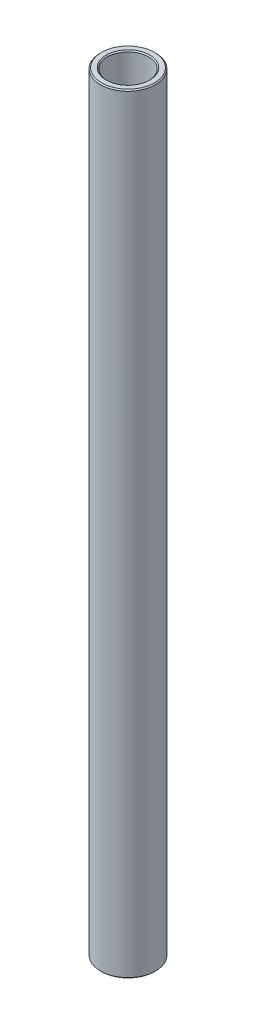
ISO-10303-21;
HEADER;
FILE_DESCRIPTION(('STEP AP214'),'2;1');
FILE_NAME('part.step','',(''),(''),'','','');
FILE_SCHEMA(('AUTOMOTIVE_DESIGN { 1 0 10303 214 1 1 1 1 }'));
ENDSEC;
DATA;
#1=APPLICATION_CONTEXT('core data for automotive mechanical design processes');
#2=APPLICATION_PROTOCOL_DEFINITION('international standard','automotive_design',2000,#1);
#3=PRODUCT_CONTEXT('',#1,'mechanical');
#4=PRODUCT('Part','Part','',(#3));
#5=PRODUCT_RELATED_PRODUCT_CATEGORY('part','',(#4));
#6=PRODUCT_DEFINITION_FORMATION('','',#4);
#7=PRODUCT_DEFINITION_CONTEXT('part definition',#1,'design');
#8=PRODUCT_DEFINITION('design','',#6,#7);
#9=PRODUCT_DEFINITION_SHAPE('','',#8);
#10=(LENGTH_UNIT() NAMED_UNIT(*) SI_UNIT(.MILLI.,.METRE.));
#11=(NAMED_UNIT(*) PLANE_ANGLE_UNIT() SI_UNIT($,.RADIAN.));
#12=(NAMED_UNIT(*) SI_UNIT($,.STERADIAN.) SOLID_ANGLE_UNIT());
#13=UNCERTAINTY_MEASURE_WITH_UNIT(LENGTH_MEASURE(1.E-05),#10,'distance_accuracy_value','');
#14=(GEOMETRIC_REPRESENTATION_CONTEXT(3) GLOBAL_UNCERTAINTY_ASSIGNED_CONTEXT((#13)) GLOBAL_UNIT_ASSIGNED_CONTEXT((#10,
#11,#12)) REPRESENTATION_CONTEXT('',''));
#15=CARTESIAN_POINT('',(0.,0.,0.));
#16=DIRECTION('',(0.,0.,1.));
#17=DIRECTION('',(1.,0.,0.));
#18=AXIS2_PLACEMENT_3D('',#15,#16,#17);
#19=CARTESIAN_POINT('',(6.35000000000027,9.52499999999973,0.));
#20=DIRECTION('',(-3.45055168679808E-13,-1.,0.));
#21=DIRECTION('',(1.,-3.45055168679808E-13,0.));
#22=AXIS2_PLACEMENT_3D('',#19,#20,#21);
#23=PLANE('',#22);
#24=CARTESIAN_POINT('',(3.28665048167583E-12,9.52500000000192,0.));
#25=DIRECTION('',(-3.45055168679808E-13,-1.,0.));
#26=DIRECTION('',(1.,-3.45055168679808E-13,0.));
#27=AXIS2_PLACEMENT_3D('',#24,#25,#26);
#28=CIRCLE('',#27,5.01649999999647);
#29=CARTESIAN_POINT('',(5.01649999999976,9.52500000000019,0.));
#30=VERTEX_POINT('',#29);
#31=EDGE_CURVE('E10',#30,#30,#28,.F.);
#32=ORIENTED_EDGE('',*,*,#31,.T.);
#33=EDGE_LOOP('',(#32));
#34=FACE_BOUND('',#33,.T.);
#35=CARTESIAN_POINT('',(3.28665048167583E-12,9.52500000000192,0.));
#36=DIRECTION('',(-3.45055168679808E-13,-1.,0.));
#37=DIRECTION('',(1.,-3.45055168679808E-13,0.));
#38=AXIS2_PLACEMENT_3D('',#35,#36,#37);
#39=CIRCLE('',#38,6.09599999999674);
#40=CARTESIAN_POINT('',(6.09600000000002,9.52499999999982,0.));
#41=VERTEX_POINT('',#40);
#42=EDGE_CURVE('E38',#41,#41,#39,.T.);
#43=ORIENTED_EDGE('',*,*,#42,.T.);
#44=EDGE_LOOP('',(#43));
#45=FACE_BOUND('',#44,.T.);
#46=ADVANCED_FACE('F31',(#34,#45),#23,.T.);
#47=CARTESIAN_POINT('',(0.,0.,0.));
#48=DIRECTION('',(-3.45055168679808E-13,-1.,0.));
#49=DIRECTION('',(1.,-3.45055168679808E-13,0.));
#50=AXIS2_PLACEMENT_3D('',#47,#48,#49);
#51=CYLINDRICAL_SURFACE('',#50,4.76249999996611);
#52=CARTESIAN_POINT('',(6.44325767344727E-11,186.731231938921,0.));
#53=DIRECTION('',(3.45055168679802E-13,1.,0.));
#54=DIRECTION('',(-1.,3.45055168679802E-13,0.));
#55=AXIS2_PLACEMENT_3D('',#52,#53,#54);
#56=CIRCLE('',#55,4.76249999996611);
#57=CARTESIAN_POINT('',(-4.76249999990168,186.731231938923,0.));
#58=VERTEX_POINT('',#57);
#59=EDGE_CURVE('E42',#58,#58,#56,.T.);
#60=ORIENTED_EDGE('',*,*,#59,.T.);
#61=EDGE_LOOP('',(#60));
#62=FACE_BOUND('',#61,.T.);
#63=CARTESIAN_POINT('',(3.37429449453098E-12,9.77900000003229,0.));
#64=DIRECTION('',(-3.45055168679807E-13,-1.,0.));
#65=DIRECTION('',(1.,-3.45055168679807E-13,0.));
#66=AXIS2_PLACEMENT_3D('',#63,#64,#65);
#67=CIRCLE('',#66,4.76249999996611);
#68=CARTESIAN_POINT('',(4.76249999996948,9.77900000003065,0.));
#69=VERTEX_POINT('',#68);
#70=EDGE_CURVE('E46',#69,#69,#67,.T.);
#71=ORIENTED_EDGE('',*,*,#70,.T.);
#72=EDGE_LOOP('',(#71));
#73=FACE_BOUND('',#72,.T.);
#74=ADVANCED_FACE('F75',(#62,#73),#51,.F.);
#75=CARTESIAN_POINT('',(4.76250000000001,186.985231938889,0.));
#76=DIRECTION('',(3.45055168679808E-13,1.,0.));
#77=DIRECTION('',(-1.,3.45055168679808E-13,0.));
#78=AXIS2_PLACEMENT_3D('',#75,#76,#77);
#79=PLANE('',#78);
#80=CARTESIAN_POINT('',(6.45202207473069E-11,186.985231938891,0.));
#81=DIRECTION('',(3.45055168679808E-13,1.,0.));
#82=DIRECTION('',(-1.,3.45055168679808E-13,0.));
#83=AXIS2_PLACEMENT_3D('',#80,#81,#82);
#84=CIRCLE('',#83,6.09599999993594);
#85=CARTESIAN_POINT('',(-6.09599999987142,186.985231938893,0.));
#86=VERTEX_POINT('',#85);
#87=EDGE_CURVE('E51',#86,#86,#84,.T.);
#88=ORIENTED_EDGE('',*,*,#87,.T.);
#89=EDGE_LOOP('',(#88));
#90=FACE_BOUND('',#89,.T.);
#91=CARTESIAN_POINT('',(6.45202207473069E-11,186.985231938891,0.));
#92=DIRECTION('',(3.45055168679808E-13,1.,0.));
#93=DIRECTION('',(-1.,3.45055168679808E-13,0.));
#94=AXIS2_PLACEMENT_3D('',#91,#92,#93);
#95=CIRCLE('',#94,5.01649999993575);
#96=CARTESIAN_POINT('',(-5.01649999987123,186.985231938893,0.));
#97=VERTEX_POINT('',#96);
#98=EDGE_CURVE('E54',#97,#97,#95,.F.);
#99=ORIENTED_EDGE('',*,*,#98,.T.);
#100=EDGE_LOOP('',(#99));
#101=FACE_BOUND('',#100,.T.);
#102=ADVANCED_FACE('F80',(#90,#101),#79,.T.);
#103=CARTESIAN_POINT('',(0.,0.,0.));
#104=DIRECTION('',(-3.45055168679808E-13,-1.,0.));
#105=DIRECTION('',(1.,-3.45055168679808E-13,0.));
#106=AXIS2_PLACEMENT_3D('',#103,#104,#105);
#107=CYLINDRICAL_SURFACE('',#106,6.34999999996637);
#108=CARTESIAN_POINT('',(6.44325767344518E-11,186.73123193886,0.));
#109=DIRECTION('',(3.45055168679803E-13,1.,0.));
#110=DIRECTION('',(-1.,3.45055168679803E-13,0.));
#111=AXIS2_PLACEMENT_3D('',#108,#109,#110);
#112=CIRCLE('',#111,6.34999999996637);
#113=CARTESIAN_POINT('',(-6.34999999990194,186.731231938863,0.));
#114=VERTEX_POINT('',#113);
#115=EDGE_CURVE('E57',#114,#114,#112,.F.);
#116=ORIENTED_EDGE('',*,*,#115,.T.);
#117=EDGE_LOOP('',(#116));
#118=FACE_BOUND('',#117,.T.);
#119=CARTESIAN_POINT('',(3.37429449451003E-12,9.77899999997156,0.));
#120=DIRECTION('',(-3.45055168679807E-13,-1.,0.));
#121=DIRECTION('',(1.,-3.45055168679807E-13,0.));
#122=AXIS2_PLACEMENT_3D('',#119,#120,#121);
#123=CIRCLE('',#122,6.34999999996637);
#124=CARTESIAN_POINT('',(6.34999999996974,9.77899999996937,0.));
#125=VERTEX_POINT('',#124);
#126=EDGE_CURVE('E60',#125,#125,#123,.F.);
#127=ORIENTED_EDGE('',*,*,#126,.T.);
#128=EDGE_LOOP('',(#127));
#129=FACE_BOUND('',#128,.T.);
#130=ADVANCED_FACE('F64',(#118,#129),#107,.T.);
#131=CARTESIAN_POINT('',(6.44325767344518E-11,186.73123193886,0.));
#132=DIRECTION('',(-3.45055168679803E-13,-1.,0.));
#133=DIRECTION('',(1.,-3.45055168679803E-13,0.));
#134=AXIS2_PLACEMENT_3D('',#131,#132,#133);
#135=CONICAL_SURFACE('',#134,6.34999999996637,0.785398163397547);
#136=ORIENTED_EDGE('',*,*,#87,.F.);
#137=EDGE_LOOP('',(#136));
#138=FACE_BOUND('',#137,.T.);
#139=ORIENTED_EDGE('',*,*,#115,.F.);
#140=EDGE_LOOP('',(#139));
#141=FACE_BOUND('',#140,.T.);
#142=ADVANCED_FACE('F85',(#138,#141),#135,.T.);
#143=CARTESIAN_POINT('',(6.45202207473069E-11,186.985231938891,0.));
#144=DIRECTION('',(3.45055168679802E-13,1.,0.));
#145=DIRECTION('',(-1.,3.45055168679802E-13,0.));
#146=AXIS2_PLACEMENT_3D('',#143,#144,#145);
#147=CONICAL_SURFACE('',#146,5.01649999993574,0.785398163397489);
#148=ORIENTED_EDGE('',*,*,#59,.F.);
#149=EDGE_LOOP('',(#148));
#150=FACE_BOUND('',#149,.T.);
#151=ORIENTED_EDGE('',*,*,#98,.F.);
#152=EDGE_LOOP('',(#151));
#153=FACE_BOUND('',#152,.T.);
#154=ADVANCED_FACE('F72',(#150,#153),#147,.F.);
#155=CARTESIAN_POINT('',(3.37429449453098E-12,9.77900000003229,0.));
#156=DIRECTION('',(-3.45055168679807E-13,-1.,0.));
#157=DIRECTION('',(1.,-3.45055168679807E-13,0.));
#158=AXIS2_PLACEMENT_3D('',#155,#156,#157);
#159=CONICAL_SURFACE('',#158,4.76249999996611,0.785398163397435);
#160=ORIENTED_EDGE('',*,*,#31,.F.);
#161=EDGE_LOOP('',(#160));
#162=FACE_BOUND('',#161,.T.);
#163=ORIENTED_EDGE('',*,*,#70,.F.);
#164=EDGE_LOOP('',(#163));
#165=FACE_BOUND('',#164,.T.);
#166=ADVANCED_FACE('F68',(#162,#165),#159,.F.);
#167=CARTESIAN_POINT('',(3.28665048167583E-12,9.52500000000192,0.));
#168=DIRECTION('',(3.45055168679807E-13,1.,0.));
#169=DIRECTION('',(-1.,3.45055168679807E-13,0.));
#170=AXIS2_PLACEMENT_3D('',#167,#168,#169);
#171=CONICAL_SURFACE('',#170,6.09599999999674,0.785398163397431);
#172=ORIENTED_EDGE('',*,*,#126,.F.);
#173=EDGE_LOOP('',(#172));
#174=FACE_BOUND('',#173,.T.);
#175=ORIENTED_EDGE('',*,*,#42,.F.);
#176=EDGE_LOOP('',(#175));
#177=FACE_BOUND('',#176,.T.);
#178=ADVANCED_FACE('F33',(#174,#177),#171,.T.);
#179=CLOSED_SHELL('',(#46,#74,#102,#130,#142,#154,#166,#178));
#180=MANIFOLD_SOLID_BREP('B2',#179);
#181=ADVANCED_BREP_SHAPE_REPRESENTATION('',(#18,#180),#14);
#182=SHAPE_DEFINITION_REPRESENTATION(#9,#181);
ENDSEC;
END-ISO-10303-21;
